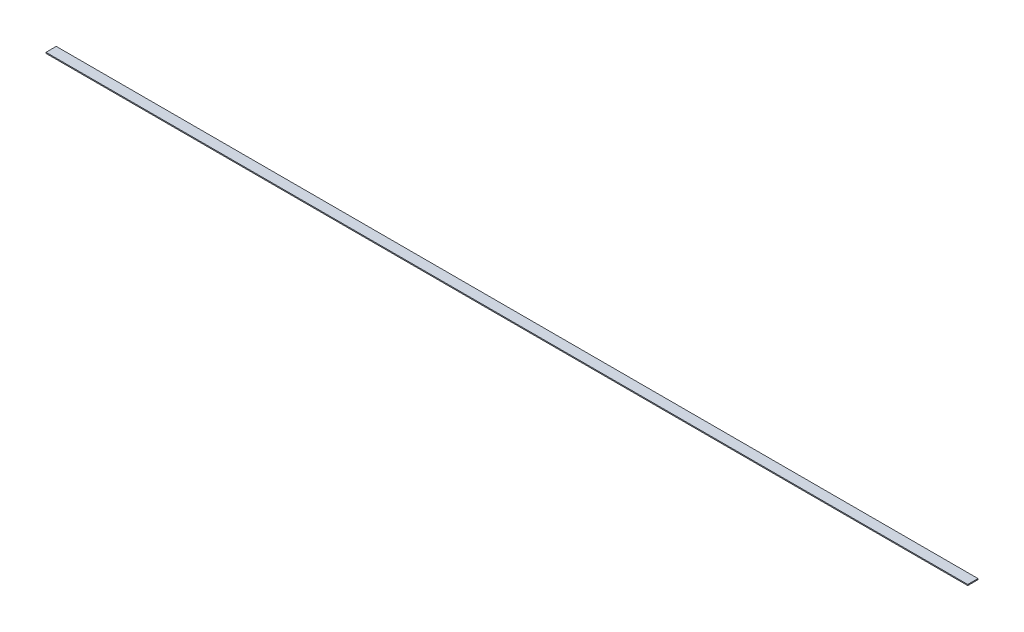
ISO-10303-21;
HEADER;
FILE_DESCRIPTION(('STEP AP214'),'2;1');
FILE_NAME('part.step','',(''),(''),'','','');
FILE_SCHEMA(('AUTOMOTIVE_DESIGN { 1 0 10303 214 1 1 1 1 }'));
ENDSEC;
DATA;
#1=APPLICATION_CONTEXT('core data for automotive mechanical design processes');
#2=APPLICATION_PROTOCOL_DEFINITION('international standard','automotive_design',2000,#1);
#3=PRODUCT_CONTEXT('',#1,'mechanical');
#4=PRODUCT('Part','Part','',(#3));
#5=PRODUCT_RELATED_PRODUCT_CATEGORY('part','',(#4));
#6=PRODUCT_DEFINITION_FORMATION('','',#4);
#7=PRODUCT_DEFINITION_CONTEXT('part definition',#1,'design');
#8=PRODUCT_DEFINITION('design','',#6,#7);
#9=PRODUCT_DEFINITION_SHAPE('','',#8);
#10=(LENGTH_UNIT() NAMED_UNIT(*) SI_UNIT(.MILLI.,.METRE.));
#11=(NAMED_UNIT(*) PLANE_ANGLE_UNIT() SI_UNIT($,.RADIAN.));
#12=(NAMED_UNIT(*) SI_UNIT($,.STERADIAN.) SOLID_ANGLE_UNIT());
#13=UNCERTAINTY_MEASURE_WITH_UNIT(LENGTH_MEASURE(1.E-05),#10,'distance_accuracy_value','');
#14=(GEOMETRIC_REPRESENTATION_CONTEXT(3) GLOBAL_UNCERTAINTY_ASSIGNED_CONTEXT((#13)) GLOBAL_UNIT_ASSIGNED_CONTEXT((#10,
#11,#12)) REPRESENTATION_CONTEXT('',''));
#15=CARTESIAN_POINT('',(0.,0.,0.));
#16=DIRECTION('',(0.,0.,1.));
#17=DIRECTION('',(1.,0.,0.));
#18=AXIS2_PLACEMENT_3D('',#15,#16,#17);
#19=CARTESIAN_POINT('',(-15.2508361204013,0.5,-6.37959866220736));
#20=DIRECTION('',(1.,0.,0.));
#21=DIRECTION('',(0.,0.,-1.));
#22=AXIS2_PLACEMENT_3D('',#19,#20,#21);
#23=PLANE('',#22);
#24=DIRECTION('',(0.,0.,1.));
#25=VECTOR('',#24,1.);
#26=CARTESIAN_POINT('',(-15.2508361204013,0.,-6.37959866220736));
#27=LINE('',#26,#25);
#28=CARTESIAN_POINT('',(-15.2508361204013,0.,-6.37959866220736));
#29=VERTEX_POINT('',#28);
#30=CARTESIAN_POINT('',(-15.2508361204013,0.,-1.37959866220736));
#31=VERTEX_POINT('',#30);
#32=EDGE_CURVE('E97',#29,#31,#27,.T.);
#33=ORIENTED_EDGE('',*,*,#32,.T.);
#34=DIRECTION('',(0.,-1.,0.));
#35=VECTOR('',#34,1.);
#36=CARTESIAN_POINT('',(-15.2508361204013,0.5,-1.37959866220736));
#37=LINE('',#36,#35);
#38=CARTESIAN_POINT('',(-15.2508361204013,0.5,-1.37959866220736));
#39=VERTEX_POINT('',#38);
#40=EDGE_CURVE('E11',#39,#31,#37,.T.);
#41=ORIENTED_EDGE('',*,*,#40,.F.);
#42=DIRECTION('',(0.,0.,1.));
#43=VECTOR('',#42,1.);
#44=CARTESIAN_POINT('',(-15.2508361204013,0.5,-6.37959866220736));
#45=LINE('',#44,#43);
#46=CARTESIAN_POINT('',(-15.2508361204013,0.5,-6.37959866220736));
#47=VERTEX_POINT('',#46);
#48=EDGE_CURVE('E85',#47,#39,#45,.T.);
#49=ORIENTED_EDGE('',*,*,#48,.F.);
#50=DIRECTION('',(0.,-1.,0.));
#51=VECTOR('',#50,1.);
#52=CARTESIAN_POINT('',(-15.2508361204013,0.5,-6.37959866220736));
#53=LINE('',#52,#51);
#54=EDGE_CURVE('E93',#47,#29,#53,.T.);
#55=ORIENTED_EDGE('',*,*,#54,.T.);
#56=EDGE_LOOP('',(#33,#41,#49,#55));
#57=FACE_BOUND('',#56,.T.);
#58=ADVANCED_FACE('F34',(#57),#23,.F.);
#59=CARTESIAN_POINT('',(-15.2508361204013,0.5,-1.37959866220736));
#60=DIRECTION('',(0.,0.,-1.));
#61=DIRECTION('',(-1.,0.,0.));
#62=AXIS2_PLACEMENT_3D('',#59,#60,#61);
#63=PLANE('',#62);
#64=DIRECTION('',(1.,0.,0.));
#65=VECTOR('',#64,1.);
#66=CARTESIAN_POINT('',(-15.2508361204013,0.,-1.37959866220736));
#67=LINE('',#66,#65);
#68=CARTESIAN_POINT('',(434.749163879599,0.,-1.37959866220736));
#69=VERTEX_POINT('',#68);
#70=EDGE_CURVE('E89',#31,#69,#67,.T.);
#71=ORIENTED_EDGE('',*,*,#70,.T.);
#72=DIRECTION('',(0.,-1.,0.));
#73=VECTOR('',#72,1.);
#74=CARTESIAN_POINT('',(434.749163879599,0.5,-1.37959866220736));
#75=LINE('',#74,#73);
#76=CARTESIAN_POINT('',(434.749163879599,0.5,-1.37959866220736));
#77=VERTEX_POINT('',#76);
#78=EDGE_CURVE('E42',#77,#69,#75,.T.);
#79=ORIENTED_EDGE('',*,*,#78,.F.);
#80=DIRECTION('',(1.,0.,0.));
#81=VECTOR('',#80,1.);
#82=CARTESIAN_POINT('',(-15.2508361204013,0.5,-1.37959866220736));
#83=LINE('',#82,#81);
#84=EDGE_CURVE('E80',#39,#77,#83,.T.);
#85=ORIENTED_EDGE('',*,*,#84,.F.);
#86=ORIENTED_EDGE('',*,*,#40,.T.);
#87=EDGE_LOOP('',(#71,#79,#85,#86));
#88=FACE_BOUND('',#87,.T.);
#89=ADVANCED_FACE('F88',(#88),#63,.F.);
#90=CARTESIAN_POINT('',(434.749163879599,0.5,-6.37959866220736));
#91=DIRECTION('',(-1.,0.,0.));
#92=DIRECTION('',(0.,0.,1.));
#93=AXIS2_PLACEMENT_3D('',#90,#91,#92);
#94=PLANE('',#93);
#95=DIRECTION('',(0.,0.,-1.));
#96=VECTOR('',#95,1.);
#97=CARTESIAN_POINT('',(434.749163879599,0.,-6.37959866220736));
#98=LINE('',#97,#96);
#99=CARTESIAN_POINT('',(434.749163879599,0.,-6.37959866220736));
#100=VERTEX_POINT('',#99);
#101=EDGE_CURVE('E67',#69,#100,#98,.T.);
#102=ORIENTED_EDGE('',*,*,#101,.T.);
#103=DIRECTION('',(0.,-1.,0.));
#104=VECTOR('',#103,1.);
#105=CARTESIAN_POINT('',(434.749163879599,0.5,-6.37959866220736));
#106=LINE('',#105,#104);
#107=CARTESIAN_POINT('',(434.749163879599,0.5,-6.37959866220736));
#108=VERTEX_POINT('',#107);
#109=EDGE_CURVE('E90',#108,#100,#106,.T.);
#110=ORIENTED_EDGE('',*,*,#109,.F.);
#111=DIRECTION('',(0.,0.,-1.));
#112=VECTOR('',#111,1.);
#113=CARTESIAN_POINT('',(434.749163879599,0.5,-6.37959866220736));
#114=LINE('',#113,#112);
#115=EDGE_CURVE('E83',#77,#108,#114,.T.);
#116=ORIENTED_EDGE('',*,*,#115,.F.);
#117=ORIENTED_EDGE('',*,*,#78,.T.);
#118=EDGE_LOOP('',(#102,#110,#116,#117));
#119=FACE_BOUND('',#118,.T.);
#120=ADVANCED_FACE('F91',(#119),#94,.F.);
#121=CARTESIAN_POINT('',(-15.2508361204013,0.5,-6.37959866220736));
#122=DIRECTION('',(0.,0.,1.));
#123=DIRECTION('',(1.,0.,0.));
#124=AXIS2_PLACEMENT_3D('',#121,#122,#123);
#125=PLANE('',#124);
#126=DIRECTION('',(-1.,0.,0.));
#127=VECTOR('',#126,1.);
#128=CARTESIAN_POINT('',(-15.2508361204013,0.,-6.37959866220736));
#129=LINE('',#128,#127);
#130=EDGE_CURVE('E73',#100,#29,#129,.T.);
#131=ORIENTED_EDGE('',*,*,#130,.T.);
#132=ORIENTED_EDGE('',*,*,#54,.F.);
#133=DIRECTION('',(-1.,0.,0.));
#134=VECTOR('',#133,1.);
#135=CARTESIAN_POINT('',(-15.2508361204013,0.5,-6.37959866220736));
#136=LINE('',#135,#134);
#137=EDGE_CURVE('E50',#108,#47,#136,.T.);
#138=ORIENTED_EDGE('',*,*,#137,.F.);
#139=ORIENTED_EDGE('',*,*,#109,.T.);
#140=EDGE_LOOP('',(#131,#132,#138,#139));
#141=FACE_BOUND('',#140,.T.);
#142=ADVANCED_FACE('F104',(#141),#125,.F.);
#143=CARTESIAN_POINT('',(0.,0.5,0.));
#144=DIRECTION('',(0.,1.,0.));
#145=DIRECTION('',(0.,0.,1.));
#146=AXIS2_PLACEMENT_3D('',#143,#144,#145);
#147=PLANE('',#146);
#148=ORIENTED_EDGE('',*,*,#48,.T.);
#149=ORIENTED_EDGE('',*,*,#84,.T.);
#150=ORIENTED_EDGE('',*,*,#115,.T.);
#151=ORIENTED_EDGE('',*,*,#137,.T.);
#152=EDGE_LOOP('',(#148,#149,#150,#151));
#153=FACE_BOUND('',#152,.T.);
#154=ADVANCED_FACE('F81',(#153),#147,.T.);
#155=CARTESIAN_POINT('',(0.,0.,0.));
#156=DIRECTION('',(0.,1.,0.));
#157=DIRECTION('',(0.,0.,1.));
#158=AXIS2_PLACEMENT_3D('',#155,#156,#157);
#159=PLANE('',#158);
#160=ORIENTED_EDGE('',*,*,#32,.F.);
#161=ORIENTED_EDGE('',*,*,#130,.F.);
#162=ORIENTED_EDGE('',*,*,#101,.F.);
#163=ORIENTED_EDGE('',*,*,#70,.F.);
#164=EDGE_LOOP('',(#160,#161,#162,#163));
#165=FACE_BOUND('',#164,.T.);
#166=ADVANCED_FACE('F107',(#165),#159,.F.);
#167=CLOSED_SHELL('',(#58,#89,#120,#142,#154,#166));
#168=MANIFOLD_SOLID_BREP('B2',#167);
#169=ADVANCED_BREP_SHAPE_REPRESENTATION('',(#18,#168),#14);
#170=SHAPE_DEFINITION_REPRESENTATION(#9,#169);
ENDSEC;
END-ISO-10303-21;
